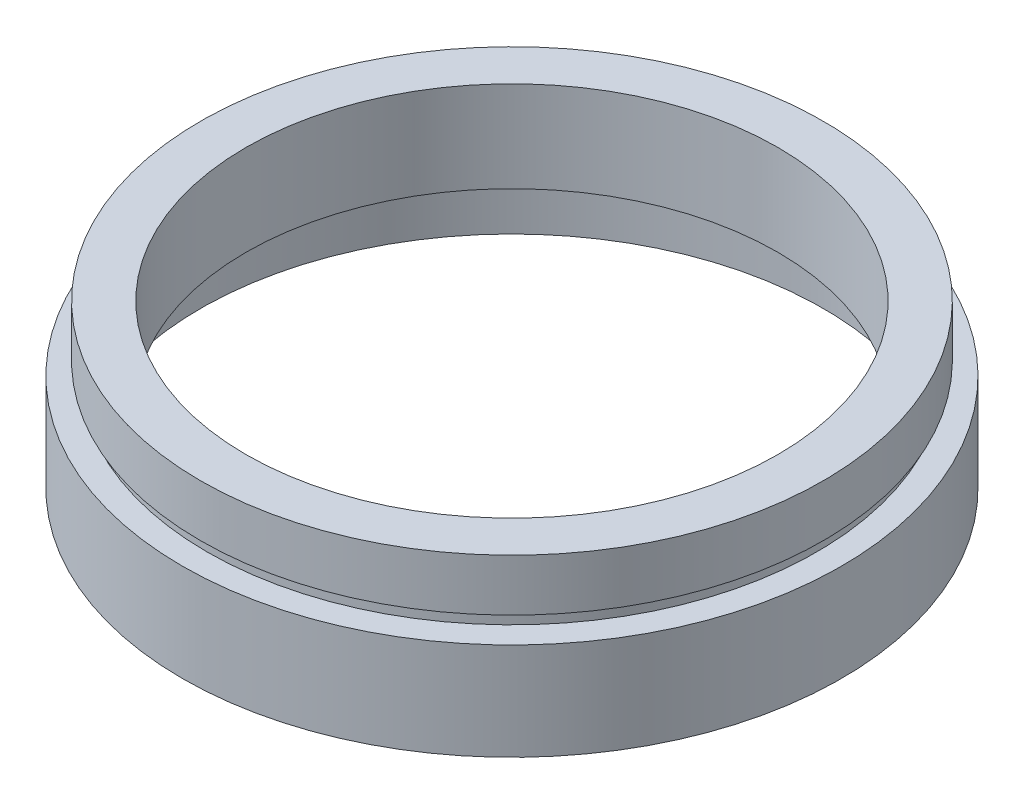
ISO-10303-21;
HEADER;
FILE_DESCRIPTION(('STEP AP214'),'2;1');
FILE_NAME('part.step','',(''),(''),'','','');
FILE_SCHEMA(('AUTOMOTIVE_DESIGN { 1 0 10303 214 1 1 1 1 }'));
ENDSEC;
DATA;
#1=APPLICATION_CONTEXT('core data for automotive mechanical design processes');
#2=APPLICATION_PROTOCOL_DEFINITION('international standard','automotive_design',2000,#1);
#3=PRODUCT_CONTEXT('',#1,'mechanical');
#4=PRODUCT('Part','Part','',(#3));
#5=PRODUCT_RELATED_PRODUCT_CATEGORY('part','',(#4));
#6=PRODUCT_DEFINITION_FORMATION('','',#4);
#7=PRODUCT_DEFINITION_CONTEXT('part definition',#1,'design');
#8=PRODUCT_DEFINITION('design','',#6,#7);
#9=PRODUCT_DEFINITION_SHAPE('','',#8);
#10=(LENGTH_UNIT() NAMED_UNIT(*) SI_UNIT(.MILLI.,.METRE.));
#11=(NAMED_UNIT(*) PLANE_ANGLE_UNIT() SI_UNIT($,.RADIAN.));
#12=(NAMED_UNIT(*) SI_UNIT($,.STERADIAN.) SOLID_ANGLE_UNIT());
#13=UNCERTAINTY_MEASURE_WITH_UNIT(LENGTH_MEASURE(1.E-05),#10,'distance_accuracy_value','');
#14=(GEOMETRIC_REPRESENTATION_CONTEXT(3) GLOBAL_UNCERTAINTY_ASSIGNED_CONTEXT((#13)) GLOBAL_UNIT_ASSIGNED_CONTEXT((#10,
#11,#12)) REPRESENTATION_CONTEXT('',''));
#15=CARTESIAN_POINT('',(0.,0.,0.));
#16=DIRECTION('',(0.,0.,1.));
#17=DIRECTION('',(1.,0.,0.));
#18=AXIS2_PLACEMENT_3D('',#15,#16,#17);
#19=CARTESIAN_POINT('',(0.,161.376166943427,0.));
#20=DIRECTION('',(0.,1.,0.));
#21=DIRECTION('',(0.,0.,1.));
#22=AXIS2_PLACEMENT_3D('',#19,#20,#21);
#23=CYLINDRICAL_SURFACE('',#22,20.5);
#24=CARTESIAN_POINT('',(0.,5.49999999999998,0.));
#25=DIRECTION('',(0.,1.,0.));
#26=DIRECTION('',(0.,0.,1.));
#27=AXIS2_PLACEMENT_3D('',#24,#25,#26);
#28=CIRCLE('',#27,20.5);
#29=CARTESIAN_POINT('',(0.,5.49999999999998,20.5));
#30=VERTEX_POINT('',#29);
#31=EDGE_CURVE('E77',#30,#30,#28,.T.);
#32=ORIENTED_EDGE('',*,*,#31,.F.);
#33=EDGE_LOOP('',(#32));
#34=FACE_BOUND('',#33,.T.);
#35=CARTESIAN_POINT('',(0.,12.5,0.));
#36=DIRECTION('',(0.,1.,0.));
#37=DIRECTION('',(0.,0.,1.));
#38=AXIS2_PLACEMENT_3D('',#35,#36,#37);
#39=CIRCLE('',#38,20.5);
#40=CARTESIAN_POINT('',(0.,12.5,20.5));
#41=VERTEX_POINT('',#40);
#42=EDGE_CURVE('E10',#41,#41,#39,.T.);
#43=ORIENTED_EDGE('',*,*,#42,.T.);
#44=EDGE_LOOP('',(#43));
#45=FACE_BOUND('',#44,.T.);
#46=ADVANCED_FACE('F37',(#34,#45),#23,.F.);
#47=CARTESIAN_POINT('',(20.5,12.5,0.));
#48=DIRECTION('',(0.,-1.,0.));
#49=DIRECTION('',(0.,0.,-1.));
#50=AXIS2_PLACEMENT_3D('',#47,#48,#49);
#51=PLANE('',#50);
#52=ORIENTED_EDGE('',*,*,#42,.F.);
#53=EDGE_LOOP('',(#52));
#54=FACE_BOUND('',#53,.T.);
#55=CARTESIAN_POINT('',(0.,12.5,0.));
#56=DIRECTION('',(0.,1.,0.));
#57=DIRECTION('',(0.,0.,1.));
#58=AXIS2_PLACEMENT_3D('',#55,#56,#57);
#59=CIRCLE('',#58,24.);
#60=CARTESIAN_POINT('',(0.,12.5,24.));
#61=VERTEX_POINT('',#60);
#62=EDGE_CURVE('E43',#61,#61,#59,.T.);
#63=ORIENTED_EDGE('',*,*,#62,.T.);
#64=EDGE_LOOP('',(#63));
#65=FACE_BOUND('',#64,.T.);
#66=ADVANCED_FACE('F84',(#54,#65),#51,.F.);
#67=CARTESIAN_POINT('',(0.,161.376166943427,0.));
#68=DIRECTION('',(0.,1.,0.));
#69=DIRECTION('',(0.,0.,1.));
#70=AXIS2_PLACEMENT_3D('',#67,#68,#69);
#71=CYLINDRICAL_SURFACE('',#70,24.);
#72=ORIENTED_EDGE('',*,*,#62,.F.);
#73=EDGE_LOOP('',(#72));
#74=FACE_BOUND('',#73,.T.);
#75=CARTESIAN_POINT('',(0.,8.49999999999998,0.));
#76=DIRECTION('',(0.,1.,0.));
#77=DIRECTION('',(0.,0.,1.));
#78=AXIS2_PLACEMENT_3D('',#75,#76,#77);
#79=CIRCLE('',#78,24.);
#80=CARTESIAN_POINT('',(0.,8.49999999999998,24.));
#81=VERTEX_POINT('',#80);
#82=EDGE_CURVE('E47',#81,#81,#79,.T.);
#83=ORIENTED_EDGE('',*,*,#82,.T.);
#84=EDGE_LOOP('',(#83));
#85=FACE_BOUND('',#84,.T.);
#86=ADVANCED_FACE('F88',(#74,#85),#71,.T.);
#87=CARTESIAN_POINT('',(24.,8.49999999999999,0.));
#88=DIRECTION('',(0.,1.,0.));
#89=DIRECTION('',(0.,0.,1.));
#90=AXIS2_PLACEMENT_3D('',#87,#88,#89);
#91=PLANE('',#90);
#92=ORIENTED_EDGE('',*,*,#82,.F.);
#93=EDGE_LOOP('',(#92));
#94=FACE_BOUND('',#93,.T.);
#95=CARTESIAN_POINT('',(0.,8.49999999999998,0.));
#96=DIRECTION('',(0.,1.,0.));
#97=DIRECTION('',(0.,0.,1.));
#98=AXIS2_PLACEMENT_3D('',#95,#96,#97);
#99=CIRCLE('',#98,23.5);
#100=CARTESIAN_POINT('',(0.,8.49999999999998,23.5));
#101=VERTEX_POINT('',#100);
#102=EDGE_CURVE('E51',#101,#101,#99,.T.);
#103=ORIENTED_EDGE('',*,*,#102,.T.);
#104=EDGE_LOOP('',(#103));
#105=FACE_BOUND('',#104,.T.);
#106=ADVANCED_FACE('F93',(#94,#105),#91,.F.);
#107=CARTESIAN_POINT('',(0.,161.376166943427,0.));
#108=DIRECTION('',(0.,1.,0.));
#109=DIRECTION('',(0.,0.,1.));
#110=AXIS2_PLACEMENT_3D('',#107,#108,#109);
#111=CYLINDRICAL_SURFACE('',#110,23.5);
#112=ORIENTED_EDGE('',*,*,#102,.F.);
#113=EDGE_LOOP('',(#112));
#114=FACE_BOUND('',#113,.T.);
#115=CARTESIAN_POINT('',(0.,7.49999999999998,0.));
#116=DIRECTION('',(0.,1.,0.));
#117=DIRECTION('',(0.,0.,1.));
#118=AXIS2_PLACEMENT_3D('',#115,#116,#117);
#119=CIRCLE('',#118,23.5);
#120=CARTESIAN_POINT('',(0.,7.49999999999998,23.5));
#121=VERTEX_POINT('',#120);
#122=EDGE_CURVE('E56',#121,#121,#119,.T.);
#123=ORIENTED_EDGE('',*,*,#122,.T.);
#124=EDGE_LOOP('',(#123));
#125=FACE_BOUND('',#124,.T.);
#126=ADVANCED_FACE('F99',(#114,#125),#111,.T.);
#127=CARTESIAN_POINT('',(23.5,7.49999999999999,0.));
#128=DIRECTION('',(0.,-1.,0.));
#129=DIRECTION('',(0.,0.,-1.));
#130=AXIS2_PLACEMENT_3D('',#127,#128,#129);
#131=PLANE('',#130);
#132=ORIENTED_EDGE('',*,*,#122,.F.);
#133=EDGE_LOOP('',(#132));
#134=FACE_BOUND('',#133,.T.);
#135=CARTESIAN_POINT('',(0.,7.49999999999998,0.));
#136=DIRECTION('',(0.,1.,0.));
#137=DIRECTION('',(0.,0.,1.));
#138=AXIS2_PLACEMENT_3D('',#135,#136,#137);
#139=CIRCLE('',#138,25.4);
#140=CARTESIAN_POINT('',(0.,7.49999999999998,25.4));
#141=VERTEX_POINT('',#140);
#142=EDGE_CURVE('E59',#141,#141,#139,.T.);
#143=ORIENTED_EDGE('',*,*,#142,.T.);
#144=EDGE_LOOP('',(#143));
#145=FACE_BOUND('',#144,.T.);
#146=ADVANCED_FACE('F103',(#134,#145),#131,.F.);
#147=CARTESIAN_POINT('',(0.,161.376166943427,0.));
#148=DIRECTION('',(0.,1.,0.));
#149=DIRECTION('',(0.,0.,1.));
#150=AXIS2_PLACEMENT_3D('',#147,#148,#149);
#151=CYLINDRICAL_SURFACE('',#150,25.4);
#152=ORIENTED_EDGE('',*,*,#142,.F.);
#153=EDGE_LOOP('',(#152));
#154=FACE_BOUND('',#153,.T.);
#155=CARTESIAN_POINT('',(0.,0.,0.));
#156=DIRECTION('',(0.,1.,0.));
#157=DIRECTION('',(0.,0.,1.));
#158=AXIS2_PLACEMENT_3D('',#155,#156,#157);
#159=CIRCLE('',#158,25.4);
#160=CARTESIAN_POINT('',(0.,0.,25.4));
#161=VERTEX_POINT('',#160);
#162=EDGE_CURVE('E62',#161,#161,#159,.T.);
#163=ORIENTED_EDGE('',*,*,#162,.T.);
#164=EDGE_LOOP('',(#163));
#165=FACE_BOUND('',#164,.T.);
#166=ADVANCED_FACE('F107',(#154,#165),#151,.T.);
#167=CARTESIAN_POINT('',(25.4,0.,0.));
#168=DIRECTION('',(0.,1.,0.));
#169=DIRECTION('',(0.,0.,1.));
#170=AXIS2_PLACEMENT_3D('',#167,#168,#169);
#171=PLANE('',#170);
#172=ORIENTED_EDGE('',*,*,#162,.F.);
#173=EDGE_LOOP('',(#172));
#174=FACE_BOUND('',#173,.T.);
#175=CARTESIAN_POINT('',(0.,0.,0.));
#176=DIRECTION('',(0.,1.,0.));
#177=DIRECTION('',(0.,0.,1.));
#178=AXIS2_PLACEMENT_3D('',#175,#176,#177);
#179=CIRCLE('',#178,24.);
#180=CARTESIAN_POINT('',(0.,0.,24.));
#181=VERTEX_POINT('',#180);
#182=EDGE_CURVE('E65',#181,#181,#179,.T.);
#183=ORIENTED_EDGE('',*,*,#182,.T.);
#184=EDGE_LOOP('',(#183));
#185=FACE_BOUND('',#184,.T.);
#186=ADVANCED_FACE('F111',(#174,#185),#171,.F.);
#187=CARTESIAN_POINT('',(0.,161.376166943427,0.));
#188=DIRECTION('',(0.,1.,0.));
#189=DIRECTION('',(0.,0.,1.));
#190=AXIS2_PLACEMENT_3D('',#187,#188,#189);
#191=CYLINDRICAL_SURFACE('',#190,24.);
#192=ORIENTED_EDGE('',*,*,#182,.F.);
#193=EDGE_LOOP('',(#192));
#194=FACE_BOUND('',#193,.T.);
#195=CARTESIAN_POINT('',(0.,4.49999999999998,0.));
#196=DIRECTION('',(0.,1.,0.));
#197=DIRECTION('',(0.,0.,1.));
#198=AXIS2_PLACEMENT_3D('',#195,#196,#197);
#199=CIRCLE('',#198,24.);
#200=CARTESIAN_POINT('',(0.,4.49999999999998,24.));
#201=VERTEX_POINT('',#200);
#202=EDGE_CURVE('E68',#201,#201,#199,.T.);
#203=ORIENTED_EDGE('',*,*,#202,.T.);
#204=EDGE_LOOP('',(#203));
#205=FACE_BOUND('',#204,.T.);
#206=ADVANCED_FACE('F115',(#194,#205),#191,.F.);
#207=CARTESIAN_POINT('',(24.,4.49999999999999,0.));
#208=DIRECTION('',(0.,-1.,0.));
#209=DIRECTION('',(0.,0.,-1.));
#210=AXIS2_PLACEMENT_3D('',#207,#208,#209);
#211=PLANE('',#210);
#212=ORIENTED_EDGE('',*,*,#202,.F.);
#213=EDGE_LOOP('',(#212));
#214=FACE_BOUND('',#213,.T.);
#215=CARTESIAN_POINT('',(0.,4.49999999999998,0.));
#216=DIRECTION('',(0.,1.,0.));
#217=DIRECTION('',(0.,0.,1.));
#218=AXIS2_PLACEMENT_3D('',#215,#216,#217);
#219=CIRCLE('',#218,24.1);
#220=CARTESIAN_POINT('',(0.,4.49999999999998,24.1));
#221=VERTEX_POINT('',#220);
#222=EDGE_CURVE('E71',#221,#221,#219,.T.);
#223=ORIENTED_EDGE('',*,*,#222,.T.);
#224=EDGE_LOOP('',(#223));
#225=FACE_BOUND('',#224,.T.);
#226=ADVANCED_FACE('F119',(#214,#225),#211,.F.);
#227=CARTESIAN_POINT('',(0.,161.376166943427,0.));
#228=DIRECTION('',(0.,1.,0.));
#229=DIRECTION('',(0.,0.,1.));
#230=AXIS2_PLACEMENT_3D('',#227,#228,#229);
#231=CYLINDRICAL_SURFACE('',#230,24.1);
#232=ORIENTED_EDGE('',*,*,#222,.F.);
#233=EDGE_LOOP('',(#232));
#234=FACE_BOUND('',#233,.T.);
#235=CARTESIAN_POINT('',(0.,5.49999999999998,0.));
#236=DIRECTION('',(0.,1.,0.));
#237=DIRECTION('',(0.,0.,1.));
#238=AXIS2_PLACEMENT_3D('',#235,#236,#237);
#239=CIRCLE('',#238,24.1);
#240=CARTESIAN_POINT('',(0.,5.49999999999998,24.1));
#241=VERTEX_POINT('',#240);
#242=EDGE_CURVE('E74',#241,#241,#239,.T.);
#243=ORIENTED_EDGE('',*,*,#242,.T.);
#244=EDGE_LOOP('',(#243));
#245=FACE_BOUND('',#244,.T.);
#246=ADVANCED_FACE('F123',(#234,#245),#231,.F.);
#247=CARTESIAN_POINT('',(24.1,5.49999999999999,0.));
#248=DIRECTION('',(0.,1.,0.));
#249=DIRECTION('',(0.,0.,1.));
#250=AXIS2_PLACEMENT_3D('',#247,#248,#249);
#251=PLANE('',#250);
#252=ORIENTED_EDGE('',*,*,#242,.F.);
#253=EDGE_LOOP('',(#252));
#254=FACE_BOUND('',#253,.T.);
#255=ORIENTED_EDGE('',*,*,#31,.T.);
#256=EDGE_LOOP('',(#255));
#257=FACE_BOUND('',#256,.T.);
#258=ADVANCED_FACE('F81',(#254,#257),#251,.F.);
#259=CLOSED_SHELL('',(#46,#66,#86,#106,#126,#146,#166,#186,#206,#226,#246,#258));
#260=MANIFOLD_SOLID_BREP('B2',#259);
#261=ADVANCED_BREP_SHAPE_REPRESENTATION('',(#18,#260),#14);
#262=SHAPE_DEFINITION_REPRESENTATION(#9,#261);
ENDSEC;
END-ISO-10303-21;
